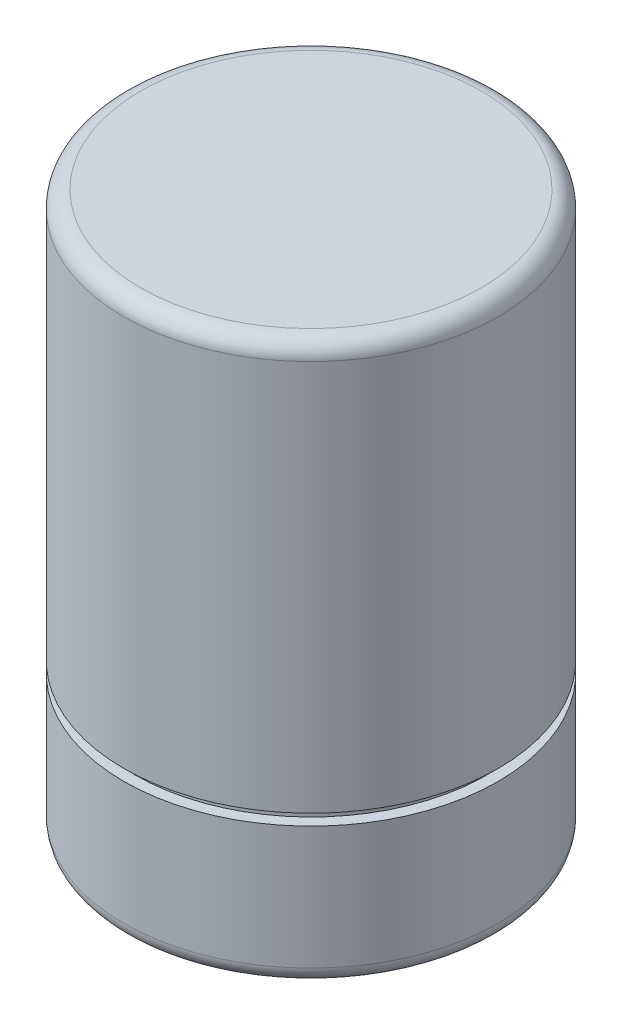
ISO-10303-21;
HEADER;
FILE_DESCRIPTION(('STEP AP214'),'2;1');
FILE_NAME('part.step','',(''),(''),'','','');
FILE_SCHEMA(('AUTOMOTIVE_DESIGN { 1 0 10303 214 1 1 1 1 }'));
ENDSEC;
DATA;
#1=APPLICATION_CONTEXT('core data for automotive mechanical design processes');
#2=APPLICATION_PROTOCOL_DEFINITION('international standard','automotive_design',2000,#1);
#3=PRODUCT_CONTEXT('',#1,'mechanical');
#4=PRODUCT('Part','Part','',(#3));
#5=PRODUCT_RELATED_PRODUCT_CATEGORY('part','',(#4));
#6=PRODUCT_DEFINITION_FORMATION('','',#4);
#7=PRODUCT_DEFINITION_CONTEXT('part definition',#1,'design');
#8=PRODUCT_DEFINITION('design','',#6,#7);
#9=PRODUCT_DEFINITION_SHAPE('','',#8);
#10=(LENGTH_UNIT() NAMED_UNIT(*) SI_UNIT(.MILLI.,.METRE.));
#11=(NAMED_UNIT(*) PLANE_ANGLE_UNIT() SI_UNIT($,.RADIAN.));
#12=(NAMED_UNIT(*) SI_UNIT($,.STERADIAN.) SOLID_ANGLE_UNIT());
#13=UNCERTAINTY_MEASURE_WITH_UNIT(LENGTH_MEASURE(1.E-05),#10,'distance_accuracy_value','');
#14=(GEOMETRIC_REPRESENTATION_CONTEXT(3) GLOBAL_UNCERTAINTY_ASSIGNED_CONTEXT((#13)) GLOBAL_UNIT_ASSIGNED_CONTEXT((#10,
#11,#12)) REPRESENTATION_CONTEXT('',''));
#15=CARTESIAN_POINT('',(0.,0.,0.));
#16=DIRECTION('',(0.,0.,1.));
#17=DIRECTION('',(1.,0.,0.));
#18=AXIS2_PLACEMENT_3D('',#15,#16,#17);
#19=CARTESIAN_POINT('',(0.,0.,-33.5));
#20=DIRECTION('',(0.,-1.,0.));
#21=DIRECTION('',(0.,0.,-1.));
#22=AXIS2_PLACEMENT_3D('',#19,#20,#21);
#23=PLANE('',#22);
#24=CARTESIAN_POINT('',(0.,0.,0.));
#25=DIRECTION('',(0.,-1.,0.));
#26=DIRECTION('',(0.,0.,-1.));
#27=AXIS2_PLACEMENT_3D('',#24,#25,#26);
#28=CIRCLE('',#27,30.5);
#29=CARTESIAN_POINT('',(0.,0.,-30.5));
#30=VERTEX_POINT('',#29);
#31=EDGE_CURVE('E45',#30,#30,#28,.T.);
#32=ORIENTED_EDGE('',*,*,#31,.T.);
#33=EDGE_LOOP('',(#32));
#34=FACE_BOUND('',#33,.T.);
#35=ADVANCED_FACE('F38',(#34),#23,.T.);
#36=CARTESIAN_POINT('',(0.,100.,0.));
#37=DIRECTION('',(0.,1.,0.));
#38=DIRECTION('',(0.,0.,1.));
#39=AXIS2_PLACEMENT_3D('',#36,#37,#38);
#40=PLANE('',#39);
#41=CARTESIAN_POINT('',(0.,100.,0.));
#42=DIRECTION('',(0.,1.,0.));
#43=DIRECTION('',(0.,0.,1.));
#44=AXIS2_PLACEMENT_3D('',#41,#42,#43);
#45=CIRCLE('',#44,30.5);
#46=CARTESIAN_POINT('',(0.,100.,30.5));
#47=VERTEX_POINT('',#46);
#48=EDGE_CURVE('E49',#47,#47,#45,.T.);
#49=ORIENTED_EDGE('',*,*,#48,.T.);
#50=EDGE_LOOP('',(#49));
#51=FACE_BOUND('',#50,.T.);
#52=ADVANCED_FACE('F88',(#51),#40,.T.);
#53=CARTESIAN_POINT('',(0.,0.,0.));
#54=DIRECTION('',(0.,-1.,0.));
#55=DIRECTION('',(0.,0.,-1.));
#56=AXIS2_PLACEMENT_3D('',#53,#54,#55);
#57=CYLINDRICAL_SURFACE('',#56,33.5);
#58=CARTESIAN_POINT('',(0.,97.,0.));
#59=DIRECTION('',(0.,1.,0.));
#60=DIRECTION('',(0.,0.,1.));
#61=AXIS2_PLACEMENT_3D('',#58,#59,#60);
#62=CIRCLE('',#61,33.5);
#63=CARTESIAN_POINT('',(0.,97.,33.5));
#64=VERTEX_POINT('',#63);
#65=EDGE_CURVE('E53',#64,#64,#62,.F.);
#66=ORIENTED_EDGE('',*,*,#65,.T.);
#67=EDGE_LOOP('',(#66));
#68=FACE_BOUND('',#67,.T.);
#69=CARTESIAN_POINT('',(0.,27.,0.));
#70=DIRECTION('',(0.,-1.,0.));
#71=DIRECTION('',(0.,0.,-1.));
#72=AXIS2_PLACEMENT_3D('',#69,#70,#71);
#73=CIRCLE('',#72,33.5);
#74=CARTESIAN_POINT('',(0.,27.,-33.5));
#75=VERTEX_POINT('',#74);
#76=EDGE_CURVE('E58',#75,#75,#73,.T.);
#77=ORIENTED_EDGE('',*,*,#76,.F.);
#78=EDGE_LOOP('',(#77));
#79=FACE_BOUND('',#78,.T.);
#80=ADVANCED_FACE('F93',(#68,#79),#57,.T.);
#81=CARTESIAN_POINT('',(0.,27.,-33.5));
#82=DIRECTION('',(0.,-1.,0.));
#83=DIRECTION('',(0.,0.,-1.));
#84=AXIS2_PLACEMENT_3D('',#81,#82,#83);
#85=PLANE('',#84);
#86=ORIENTED_EDGE('',*,*,#76,.T.);
#87=EDGE_LOOP('',(#86));
#88=FACE_BOUND('',#87,.T.);
#89=CARTESIAN_POINT('',(0.,27.,0.));
#90=DIRECTION('',(0.,-1.,0.));
#91=DIRECTION('',(0.,0.,-1.));
#92=AXIS2_PLACEMENT_3D('',#89,#90,#91);
#93=CIRCLE('',#92,31.5);
#94=CARTESIAN_POINT('',(0.,27.,-31.5));
#95=VERTEX_POINT('',#94);
#96=EDGE_CURVE('E61',#95,#95,#93,.T.);
#97=ORIENTED_EDGE('',*,*,#96,.F.);
#98=EDGE_LOOP('',(#97));
#99=FACE_BOUND('',#98,.T.);
#100=ADVANCED_FACE('F84',(#88,#99),#85,.T.);
#101=CARTESIAN_POINT('',(0.,0.,0.));
#102=DIRECTION('',(0.,-1.,0.));
#103=DIRECTION('',(0.,0.,-1.));
#104=AXIS2_PLACEMENT_3D('',#101,#102,#103);
#105=CYLINDRICAL_SURFACE('',#104,31.5);
#106=ORIENTED_EDGE('',*,*,#96,.T.);
#107=EDGE_LOOP('',(#106));
#108=FACE_BOUND('',#107,.T.);
#109=CARTESIAN_POINT('',(0.,25.,0.));
#110=DIRECTION('',(0.,-1.,0.));
#111=DIRECTION('',(0.,0.,-1.));
#112=AXIS2_PLACEMENT_3D('',#109,#110,#111);
#113=CIRCLE('',#112,31.5);
#114=CARTESIAN_POINT('',(0.,25.,-31.5));
#115=VERTEX_POINT('',#114);
#116=EDGE_CURVE('E64',#115,#115,#113,.T.);
#117=ORIENTED_EDGE('',*,*,#116,.F.);
#118=EDGE_LOOP('',(#117));
#119=FACE_BOUND('',#118,.T.);
#120=ADVANCED_FACE('F75',(#108,#119),#105,.T.);
#121=CARTESIAN_POINT('',(0.,25.,-31.5));
#122=DIRECTION('',(0.,1.,0.));
#123=DIRECTION('',(0.,0.,1.));
#124=AXIS2_PLACEMENT_3D('',#121,#122,#123);
#125=PLANE('',#124);
#126=ORIENTED_EDGE('',*,*,#116,.T.);
#127=EDGE_LOOP('',(#126));
#128=FACE_BOUND('',#127,.T.);
#129=CARTESIAN_POINT('',(0.,25.,0.));
#130=DIRECTION('',(0.,-1.,0.));
#131=DIRECTION('',(0.,0.,-1.));
#132=AXIS2_PLACEMENT_3D('',#129,#130,#131);
#133=CIRCLE('',#132,33.5);
#134=CARTESIAN_POINT('',(0.,25.,-33.5));
#135=VERTEX_POINT('',#134);
#136=EDGE_CURVE('E67',#135,#135,#133,.T.);
#137=ORIENTED_EDGE('',*,*,#136,.F.);
#138=EDGE_LOOP('',(#137));
#139=FACE_BOUND('',#138,.T.);
#140=ADVANCED_FACE('F73',(#128,#139),#125,.T.);
#141=CARTESIAN_POINT('',(0.,0.,0.));
#142=DIRECTION('',(0.,-1.,0.));
#143=DIRECTION('',(0.,0.,-1.));
#144=AXIS2_PLACEMENT_3D('',#141,#142,#143);
#145=CYLINDRICAL_SURFACE('',#144,33.5);
#146=CARTESIAN_POINT('',(0.,3.,0.));
#147=DIRECTION('',(0.,-1.,0.));
#148=DIRECTION('',(0.,0.,-1.));
#149=AXIS2_PLACEMENT_3D('',#146,#147,#148);
#150=CIRCLE('',#149,33.5);
#151=CARTESIAN_POINT('',(0.,3.,-33.5));
#152=VERTEX_POINT('',#151);
#153=EDGE_CURVE('E10',#152,#152,#150,.F.);
#154=ORIENTED_EDGE('',*,*,#153,.T.);
#155=EDGE_LOOP('',(#154));
#156=FACE_BOUND('',#155,.T.);
#157=ORIENTED_EDGE('',*,*,#136,.T.);
#158=EDGE_LOOP('',(#157));
#159=FACE_BOUND('',#158,.T.);
#160=ADVANCED_FACE('F71',(#156,#159),#145,.T.);
#161=CARTESIAN_POINT('',(0.,97.,0.));
#162=DIRECTION('',(0.,1.,0.));
#163=DIRECTION('',(0.,0.,1.));
#164=AXIS2_PLACEMENT_3D('',#161,#162,#163);
#165=TOROIDAL_SURFACE('',#164,30.5,3.);
#166=ORIENTED_EDGE('',*,*,#48,.F.);
#167=EDGE_LOOP('',(#166));
#168=FACE_BOUND('',#167,.T.);
#169=ORIENTED_EDGE('',*,*,#65,.F.);
#170=EDGE_LOOP('',(#169));
#171=FACE_BOUND('',#170,.T.);
#172=ADVANCED_FACE('F82',(#168,#171),#165,.T.);
#173=CARTESIAN_POINT('',(0.,3.,0.));
#174=DIRECTION('',(0.,-1.,0.));
#175=DIRECTION('',(0.,0.,-1.));
#176=AXIS2_PLACEMENT_3D('',#173,#174,#175);
#177=TOROIDAL_SURFACE('',#176,30.5,3.);
#178=ORIENTED_EDGE('',*,*,#153,.F.);
#179=EDGE_LOOP('',(#178));
#180=FACE_BOUND('',#179,.T.);
#181=ORIENTED_EDGE('',*,*,#31,.F.);
#182=EDGE_LOOP('',(#181));
#183=FACE_BOUND('',#182,.T.);
#184=ADVANCED_FACE('F40',(#180,#183),#177,.T.);
#185=CLOSED_SHELL('',(#35,#52,#80,#100,#120,#140,#160,#172,#184));
#186=MANIFOLD_SOLID_BREP('B2',#185);
#187=ADVANCED_BREP_SHAPE_REPRESENTATION('',(#18,#186),#14);
#188=SHAPE_DEFINITION_REPRESENTATION(#9,#187);
ENDSEC;
END-ISO-10303-21;
